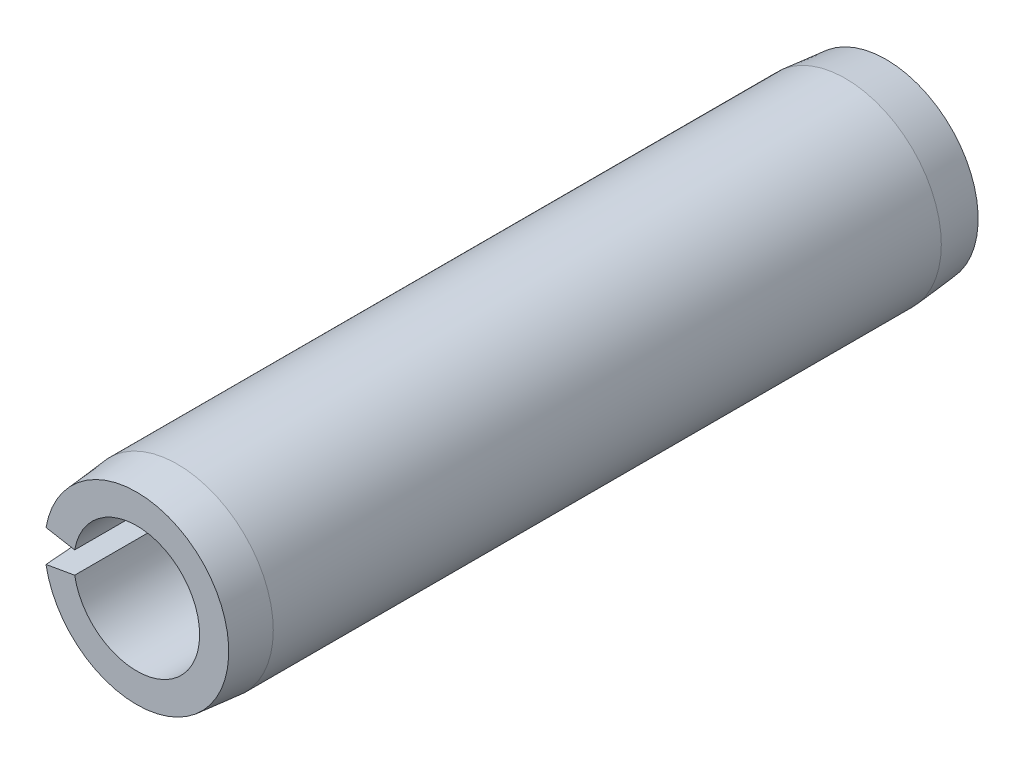
ISO-10303-21;
HEADER;
FILE_DESCRIPTION(('STEP AP214'),'2;1');
FILE_NAME('part.step','',(''),(''),'','','');
FILE_SCHEMA(('AUTOMOTIVE_DESIGN { 1 0 10303 214 1 1 1 1 }'));
ENDSEC;
DATA;
#1=APPLICATION_CONTEXT('core data for automotive mechanical design processes');
#2=APPLICATION_PROTOCOL_DEFINITION('international standard','automotive_design',2000,#1);
#3=PRODUCT_CONTEXT('',#1,'mechanical');
#4=PRODUCT('Part','Part','',(#3));
#5=PRODUCT_RELATED_PRODUCT_CATEGORY('part','',(#4));
#6=PRODUCT_DEFINITION_FORMATION('','',#4);
#7=PRODUCT_DEFINITION_CONTEXT('part definition',#1,'design');
#8=PRODUCT_DEFINITION('design','',#6,#7);
#9=PRODUCT_DEFINITION_SHAPE('','',#8);
#10=(LENGTH_UNIT() NAMED_UNIT(*) SI_UNIT(.MILLI.,.METRE.));
#11=(NAMED_UNIT(*) PLANE_ANGLE_UNIT() SI_UNIT($,.RADIAN.));
#12=(NAMED_UNIT(*) SI_UNIT($,.STERADIAN.) SOLID_ANGLE_UNIT());
#13=UNCERTAINTY_MEASURE_WITH_UNIT(LENGTH_MEASURE(1.E-05),#10,'distance_accuracy_value','');
#14=(GEOMETRIC_REPRESENTATION_CONTEXT(3) GLOBAL_UNCERTAINTY_ASSIGNED_CONTEXT((#13)) GLOBAL_UNIT_ASSIGNED_CONTEXT((#10,
#11,#12)) REPRESENTATION_CONTEXT('',''));
#15=CARTESIAN_POINT('',(0.,0.,0.));
#16=DIRECTION('',(0.,0.,1.));
#17=DIRECTION('',(1.,0.,0.));
#18=AXIS2_PLACEMENT_3D('',#15,#16,#17);
#19=CARTESIAN_POINT('',(0.,0.,22.225));
#20=DIRECTION('',(0.,0.,-1.));
#21=DIRECTION('',(-1.,0.,0.));
#22=AXIS2_PLACEMENT_3D('',#19,#20,#21);
#23=CYLINDRICAL_SURFACE('',#22,3.7338);
#24=CARTESIAN_POINT('',(0.,0.,-22.225));
#25=DIRECTION('',(0.,0.,-1.));
#26=DIRECTION('',(1.,0.,0.));
#27=AXIS2_PLACEMENT_3D('',#24,#25,#26);
#28=CIRCLE('',#27,3.7338);
#29=CARTESIAN_POINT('',(-3.67707518819698,0.648367565772772,-22.225));
#30=VERTEX_POINT('',#29);
#31=CARTESIAN_POINT('',(-3.67707518819698,-0.648367565772772,-22.225));
#32=VERTEX_POINT('',#31);
#33=EDGE_CURVE('E114',#30,#32,#28,.T.);
#34=ORIENTED_EDGE('',*,*,#33,.T.);
#35=DIRECTION('',(0.,0.,-1.));
#36=VECTOR('',#35,1.);
#37=CARTESIAN_POINT('',(-3.67707518819698,-0.648367565772772,22.225));
#38=LINE('',#37,#36);
#39=CARTESIAN_POINT('',(-3.67707518819698,-0.648367565772772,22.225));
#40=VERTEX_POINT('',#39);
#41=EDGE_CURVE('E11',#40,#32,#38,.T.);
#42=ORIENTED_EDGE('',*,*,#41,.F.);
#43=CARTESIAN_POINT('',(0.,0.,22.225));
#44=DIRECTION('',(0.,0.,-1.));
#45=DIRECTION('',(1.,0.,0.));
#46=AXIS2_PLACEMENT_3D('',#43,#44,#45);
#47=CIRCLE('',#46,3.7338);
#48=CARTESIAN_POINT('',(-3.67707518819698,0.648367565772772,22.225));
#49=VERTEX_POINT('',#48);
#50=EDGE_CURVE('E110',#49,#40,#47,.T.);
#51=ORIENTED_EDGE('',*,*,#50,.F.);
#52=DIRECTION('',(0.,0.,-1.));
#53=VECTOR('',#52,1.);
#54=CARTESIAN_POINT('',(-3.67707518819698,0.648367565772772,22.225));
#55=LINE('',#54,#53);
#56=EDGE_CURVE('E103',#49,#30,#55,.T.);
#57=ORIENTED_EDGE('',*,*,#56,.T.);
#58=EDGE_LOOP('',(#34,#42,#51,#57));
#59=FACE_BOUND('',#58,.T.);
#60=ADVANCED_FACE('F31',(#59),#23,.F.);
#61=CARTESIAN_POINT('',(-3.67707518819698,-0.648367565772772,22.225));
#62=DIRECTION('',(0.173648177666927,-0.984807753012208,0.));
#63=DIRECTION('',(0.984807753012209,0.173648177666927,0.));
#64=AXIS2_PLACEMENT_3D('',#61,#62,#63);
#65=PLANE('',#64);
#66=DIRECTION('',(0.,0.,-1.));
#67=VECTOR('',#66,1.);
#68=CARTESIAN_POINT('',(-5.60316219153826,-0.987988671653748,22.225));
#69=LINE('',#68,#67);
#70=CARTESIAN_POINT('',(-5.60316219153827,-0.987988671653748,19.812));
#71=VERTEX_POINT('',#70);
#72=CARTESIAN_POINT('',(-5.60316219153827,-0.987988671653748,-19.812));
#73=VERTEX_POINT('',#72);
#74=EDGE_CURVE('E38',#71,#73,#69,.T.);
#75=ORIENTED_EDGE('',*,*,#74,.F.);
#76=DIRECTION('',(-0.0928816978169053,-0.0163775493391306,-0.995542448159943));
#77=VECTOR('',#76,1.);
#78=CARTESIAN_POINT('',(0.,0.,79.8688888888889));
#79=LINE('',#78,#77);
#80=CARTESIAN_POINT('',(-5.37803513919968,-0.94829269823909,22.225));
#81=VERTEX_POINT('',#80);
#82=EDGE_CURVE('E85',#71,#81,#79,.F.);
#83=ORIENTED_EDGE('',*,*,#82,.T.);
#84=DIRECTION('',(-0.984807753012209,-0.173648177666927,0.));
#85=VECTOR('',#84,1.);
#86=CARTESIAN_POINT('',(-3.67707518819698,-0.648367565772772,22.225));
#87=LINE('',#86,#85);
#88=EDGE_CURVE('E118',#40,#81,#87,.T.);
#89=ORIENTED_EDGE('',*,*,#88,.F.);
#90=ORIENTED_EDGE('',*,*,#41,.T.);
#91=DIRECTION('',(-0.984807753012209,-0.173648177666927,0.));
#92=VECTOR('',#91,1.);
#93=CARTESIAN_POINT('',(-3.67707518819698,-0.648367565772772,-22.225));
#94=LINE('',#93,#92);
#95=CARTESIAN_POINT('',(-5.37803513919967,-0.94829269823909,-22.225));
#96=VERTEX_POINT('',#95);
#97=EDGE_CURVE('E111',#32,#96,#94,.T.);
#98=ORIENTED_EDGE('',*,*,#97,.T.);
#99=DIRECTION('',(0.0928816978169053,0.0163775493391306,-0.995542448159943));
#100=VECTOR('',#99,1.);
#101=CARTESIAN_POINT('',(0.,0.,-79.8688888888889));
#102=LINE('',#101,#100);
#103=EDGE_CURVE('E53',#96,#73,#102,.F.);
#104=ORIENTED_EDGE('',*,*,#103,.T.);
#105=EDGE_LOOP('',(#75,#83,#89,#90,#98,#104));
#106=FACE_BOUND('',#105,.T.);
#107=ADVANCED_FACE('F132',(#106),#65,.F.);
#108=CARTESIAN_POINT('',(0.,0.,22.225));
#109=DIRECTION('',(0.,0.,-1.));
#110=DIRECTION('',(-1.,0.,0.));
#111=AXIS2_PLACEMENT_3D('',#108,#109,#110);
#112=CYLINDRICAL_SURFACE('',#111,5.6896);
#113=DIRECTION('',(0.,0.,-1.));
#114=VECTOR('',#113,1.);
#115=CARTESIAN_POINT('',(-5.60316219153826,0.987988671653749,22.225));
#116=LINE('',#115,#114);
#117=CARTESIAN_POINT('',(-5.60316219153827,0.98798867165375,19.812));
#118=VERTEX_POINT('',#117);
#119=CARTESIAN_POINT('',(-5.60316219153827,0.987988671653749,-19.812));
#120=VERTEX_POINT('',#119);
#121=EDGE_CURVE('E95',#118,#120,#116,.T.);
#122=ORIENTED_EDGE('',*,*,#121,.F.);
#123=CARTESIAN_POINT('',(0.,0.,19.812));
#124=DIRECTION('',(0.,0.,-1.));
#125=DIRECTION('',(-1.,0.,0.));
#126=AXIS2_PLACEMENT_3D('',#123,#124,#125);
#127=CIRCLE('',#126,5.6896);
#128=EDGE_CURVE('E82',#118,#71,#127,.T.);
#129=ORIENTED_EDGE('',*,*,#128,.T.);
#130=ORIENTED_EDGE('',*,*,#74,.T.);
#131=CARTESIAN_POINT('',(0.,0.,-19.812));
#132=DIRECTION('',(0.,0.,-1.));
#133=DIRECTION('',(-1.,0.,0.));
#134=AXIS2_PLACEMENT_3D('',#131,#132,#133);
#135=CIRCLE('',#134,5.6896);
#136=EDGE_CURVE('E102',#120,#73,#135,.T.);
#137=ORIENTED_EDGE('',*,*,#136,.F.);
#138=EDGE_LOOP('',(#122,#129,#130,#137));
#139=FACE_BOUND('',#138,.T.);
#140=ADVANCED_FACE('F101',(#139),#112,.T.);
#141=CARTESIAN_POINT('',(-5.60316219153826,0.987988671653749,22.225));
#142=DIRECTION('',(0.173648177666927,0.984807753012208,0.));
#143=DIRECTION('',(-0.984807753012209,0.173648177666927,0.));
#144=AXIS2_PLACEMENT_3D('',#141,#142,#143);
#145=PLANE('',#144);
#146=DIRECTION('',(0.984807753012209,-0.173648177666927,0.));
#147=VECTOR('',#146,1.);
#148=CARTESIAN_POINT('',(-5.60316219153826,0.987988671653749,22.225));
#149=LINE('',#148,#147);
#150=CARTESIAN_POINT('',(-5.37803513919967,0.94829269823909,22.225));
#151=VERTEX_POINT('',#150);
#152=EDGE_CURVE('E98',#151,#49,#149,.T.);
#153=ORIENTED_EDGE('',*,*,#152,.F.);
#154=DIRECTION('',(0.0928816978169053,-0.0163775493391306,0.995542448159943));
#155=VECTOR('',#154,1.);
#156=CARTESIAN_POINT('',(0.,0.,79.8688888888889));
#157=LINE('',#156,#155);
#158=EDGE_CURVE('E45',#151,#118,#157,.F.);
#159=ORIENTED_EDGE('',*,*,#158,.T.);
#160=ORIENTED_EDGE('',*,*,#121,.T.);
#161=DIRECTION('',(-0.0928816978169053,0.0163775493391306,0.995542448159943));
#162=VECTOR('',#161,1.);
#163=CARTESIAN_POINT('',(0.,0.,-79.8688888888889));
#164=LINE('',#163,#162);
#165=CARTESIAN_POINT('',(-5.37803513919967,0.94829269823909,-22.225));
#166=VERTEX_POINT('',#165);
#167=EDGE_CURVE('E124',#120,#166,#164,.F.);
#168=ORIENTED_EDGE('',*,*,#167,.T.);
#169=DIRECTION('',(0.984807753012209,-0.173648177666927,0.));
#170=VECTOR('',#169,1.);
#171=CARTESIAN_POINT('',(-5.60316219153826,0.987988671653749,-22.225));
#172=LINE('',#171,#170);
#173=EDGE_CURVE('E108',#166,#30,#172,.T.);
#174=ORIENTED_EDGE('',*,*,#173,.T.);
#175=ORIENTED_EDGE('',*,*,#56,.F.);
#176=EDGE_LOOP('',(#153,#159,#160,#168,#174,#175));
#177=FACE_BOUND('',#176,.T.);
#178=ADVANCED_FACE('F93',(#177),#145,.F.);
#179=CARTESIAN_POINT('',(0.,0.,22.225));
#180=DIRECTION('',(0.,0.,1.));
#181=DIRECTION('',(1.,0.,0.));
#182=AXIS2_PLACEMENT_3D('',#179,#180,#181);
#183=PLANE('',#182);
#184=CARTESIAN_POINT('',(0.,0.,22.225));
#185=DIRECTION('',(0.,0.,-1.));
#186=DIRECTION('',(-1.,0.,0.));
#187=AXIS2_PLACEMENT_3D('',#184,#185,#186);
#188=CIRCLE('',#187,5.461);
#189=EDGE_CURVE('E89',#151,#81,#188,.T.);
#190=ORIENTED_EDGE('',*,*,#189,.F.);
#191=ORIENTED_EDGE('',*,*,#152,.T.);
#192=ORIENTED_EDGE('',*,*,#50,.T.);
#193=ORIENTED_EDGE('',*,*,#88,.T.);
#194=EDGE_LOOP('',(#190,#191,#192,#193));
#195=FACE_BOUND('',#194,.T.);
#196=ADVANCED_FACE('F133',(#195),#183,.T.);
#197=CARTESIAN_POINT('',(0.,0.,-22.225));
#198=DIRECTION('',(0.,0.,1.));
#199=DIRECTION('',(1.,0.,0.));
#200=AXIS2_PLACEMENT_3D('',#197,#198,#199);
#201=PLANE('',#200);
#202=ORIENTED_EDGE('',*,*,#173,.F.);
#203=CARTESIAN_POINT('',(0.,0.,-22.225));
#204=DIRECTION('',(0.,0.,-1.));
#205=DIRECTION('',(-1.,0.,0.));
#206=AXIS2_PLACEMENT_3D('',#203,#204,#205);
#207=CIRCLE('',#206,5.461);
#208=EDGE_CURVE('E126',#166,#96,#207,.T.);
#209=ORIENTED_EDGE('',*,*,#208,.T.);
#210=ORIENTED_EDGE('',*,*,#97,.F.);
#211=ORIENTED_EDGE('',*,*,#33,.F.);
#212=EDGE_LOOP('',(#202,#209,#210,#211));
#213=FACE_BOUND('',#212,.T.);
#214=ADVANCED_FACE('F140',(#213),#201,.F.);
#215=CARTESIAN_POINT('',(0.,0.,-19.812));
#216=DIRECTION('',(0.,0.,1.));
#217=DIRECTION('',(1.,0.,0.));
#218=AXIS2_PLACEMENT_3D('',#215,#216,#217);
#219=CONICAL_SURFACE('',#218,5.6896,0.0944549353950466);
#220=ORIENTED_EDGE('',*,*,#208,.F.);
#221=ORIENTED_EDGE('',*,*,#167,.F.);
#222=ORIENTED_EDGE('',*,*,#136,.T.);
#223=ORIENTED_EDGE('',*,*,#103,.F.);
#224=EDGE_LOOP('',(#220,#221,#222,#223));
#225=FACE_BOUND('',#224,.T.);
#226=ADVANCED_FACE('F141',(#225),#219,.T.);
#227=CARTESIAN_POINT('',(0.,0.,22.225));
#228=DIRECTION('',(0.,0.,-1.));
#229=DIRECTION('',(-1.,0.,0.));
#230=AXIS2_PLACEMENT_3D('',#227,#228,#229);
#231=CONICAL_SURFACE('',#230,5.461,0.0944549353950466);
#232=ORIENTED_EDGE('',*,*,#128,.F.);
#233=ORIENTED_EDGE('',*,*,#158,.F.);
#234=ORIENTED_EDGE('',*,*,#189,.T.);
#235=ORIENTED_EDGE('',*,*,#82,.F.);
#236=EDGE_LOOP('',(#232,#233,#234,#235));
#237=FACE_BOUND('',#236,.T.);
#238=ADVANCED_FACE('F83',(#237),#231,.T.);
#239=CLOSED_SHELL('',(#60,#107,#140,#178,#196,#214,#226,#238));
#240=MANIFOLD_SOLID_BREP('B2',#239);
#241=ADVANCED_BREP_SHAPE_REPRESENTATION('',(#18,#240),#14);
#242=SHAPE_DEFINITION_REPRESENTATION(#9,#241);
ENDSEC;
END-ISO-10303-21;
